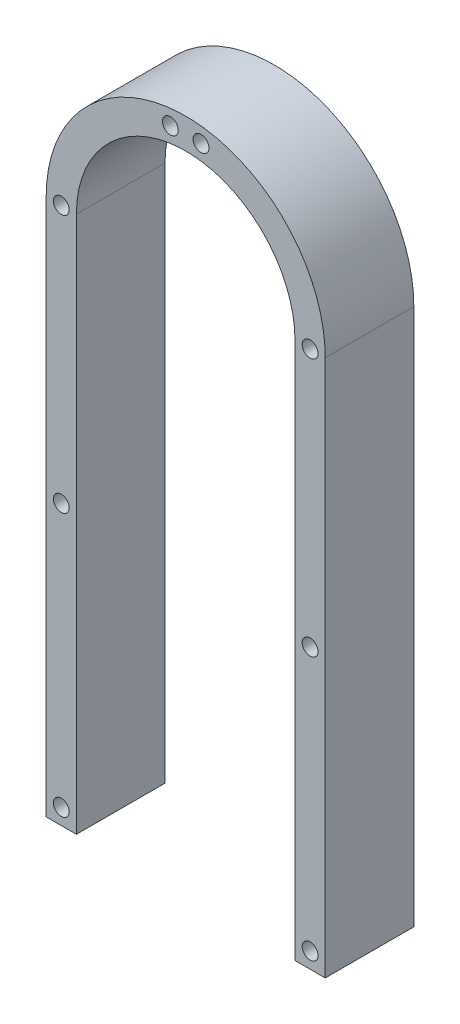
ISO-10303-21;
HEADER;
FILE_DESCRIPTION(('STEP AP214'),'2;1');
FILE_NAME('part.step','',(''),(''),'','','');
FILE_SCHEMA(('AUTOMOTIVE_DESIGN { 1 0 10303 214 1 1 1 1 }'));
ENDSEC;
DATA;
#1=APPLICATION_CONTEXT('core data for automotive mechanical design processes');
#2=APPLICATION_PROTOCOL_DEFINITION('international standard','automotive_design',2000,#1);
#3=PRODUCT_CONTEXT('',#1,'mechanical');
#4=PRODUCT('Part','Part','',(#3));
#5=PRODUCT_RELATED_PRODUCT_CATEGORY('part','',(#4));
#6=PRODUCT_DEFINITION_FORMATION('','',#4);
#7=PRODUCT_DEFINITION_CONTEXT('part definition',#1,'design');
#8=PRODUCT_DEFINITION('design','',#6,#7);
#9=PRODUCT_DEFINITION_SHAPE('','',#8);
#10=(LENGTH_UNIT() NAMED_UNIT(*) SI_UNIT(.MILLI.,.METRE.));
#11=(NAMED_UNIT(*) PLANE_ANGLE_UNIT() SI_UNIT($,.RADIAN.));
#12=(NAMED_UNIT(*) SI_UNIT($,.STERADIAN.) SOLID_ANGLE_UNIT());
#13=UNCERTAINTY_MEASURE_WITH_UNIT(LENGTH_MEASURE(1.E-05),#10,'distance_accuracy_value','');
#14=(GEOMETRIC_REPRESENTATION_CONTEXT(3) GLOBAL_UNCERTAINTY_ASSIGNED_CONTEXT((#13)) GLOBAL_UNIT_ASSIGNED_CONTEXT((#10,
#11,#12)) REPRESENTATION_CONTEXT('',''));
#15=CARTESIAN_POINT('',(0.,0.,0.));
#16=DIRECTION('',(0.,0.,1.));
#17=DIRECTION('',(1.,0.,0.));
#18=AXIS2_PLACEMENT_3D('',#15,#16,#17);
#19=CARTESIAN_POINT('',(-149.085368150531,-18.7891941834329,19.05));
#20=DIRECTION('',(0.,0.,1.));
#21=DIRECTION('',(1.,0.,0.));
#22=AXIS2_PLACEMENT_3D('',#19,#20,#21);
#23=PLANE('',#22);
#24=DIRECTION('',(-1.,0.,0.));
#25=VECTOR('',#24,1.);
#26=CARTESIAN_POINT('',(-149.085368150531,96.6995702810626,19.05));
#27=LINE('',#26,#25);
#28=CARTESIAN_POINT('',(-119.085368150531,96.6995702810626,19.05));
#29=VERTEX_POINT('',#28);
#30=CARTESIAN_POINT('',(-125.585368150531,96.6995702810626,19.05));
#31=VERTEX_POINT('',#30);
#32=EDGE_CURVE('E52',#29,#31,#27,.T.);
#33=ORIENTED_EDGE('',*,*,#32,.F.);
#34=DIRECTION('',(0.,1.,0.));
#35=VECTOR('',#34,1.);
#36=CARTESIAN_POINT('',(-119.085368150531,-18.7891941834329,19.05));
#37=LINE('',#36,#35);
#38=CARTESIAN_POINT('',(-119.085368150531,212.188334745558,19.05));
#39=VERTEX_POINT('',#38);
#40=EDGE_CURVE('E112',#29,#39,#37,.T.);
#41=ORIENTED_EDGE('',*,*,#40,.T.);
#42=CARTESIAN_POINT('',(-149.085368150531,212.188334745558,19.05));
#43=DIRECTION('',(0.,0.,1.));
#44=DIRECTION('',(1.,0.,0.));
#45=AXIS2_PLACEMENT_3D('',#42,#43,#44);
#46=CIRCLE('',#45,30.);
#47=CARTESIAN_POINT('',(-179.085368150531,212.188334745558,19.05));
#48=VERTEX_POINT('',#47);
#49=EDGE_CURVE('E120',#39,#48,#46,.T.);
#50=ORIENTED_EDGE('',*,*,#49,.T.);
#51=DIRECTION('',(0.,-1.,0.));
#52=VECTOR('',#51,1.);
#53=CARTESIAN_POINT('',(-179.085368150531,-18.7891941834329,19.05));
#54=LINE('',#53,#52);
#55=CARTESIAN_POINT('',(-179.085368150531,96.6995702810626,19.05));
#56=VERTEX_POINT('',#55);
#57=EDGE_CURVE('E123',#48,#56,#54,.T.);
#58=ORIENTED_EDGE('',*,*,#57,.T.);
#59=CARTESIAN_POINT('',(-172.585368150531,96.6995702810626,19.05));
#60=VERTEX_POINT('',#59);
#61=EDGE_CURVE('E116',#60,#56,#27,.T.);
#62=ORIENTED_EDGE('',*,*,#61,.F.);
#63=DIRECTION('',(0.,-1.,0.));
#64=VECTOR('',#63,1.);
#65=CARTESIAN_POINT('',(-172.585368150531,-18.7891941834329,19.05));
#66=LINE('',#65,#64);
#67=CARTESIAN_POINT('',(-172.585368150531,212.188334745558,19.05));
#68=VERTEX_POINT('',#67);
#69=EDGE_CURVE('E154',#68,#60,#66,.T.);
#70=ORIENTED_EDGE('',*,*,#69,.F.);
#71=CARTESIAN_POINT('',(-149.085368150531,212.188334745558,19.05));
#72=DIRECTION('',(0.,0.,1.));
#73=DIRECTION('',(1.,0.,0.));
#74=AXIS2_PLACEMENT_3D('',#71,#72,#73);
#75=CIRCLE('',#74,23.5);
#76=CARTESIAN_POINT('',(-125.585368150531,212.188334745558,19.05));
#77=VERTEX_POINT('',#76);
#78=EDGE_CURVE('E160',#77,#68,#75,.T.);
#79=ORIENTED_EDGE('',*,*,#78,.F.);
#80=DIRECTION('',(0.,1.,0.));
#81=VECTOR('',#80,1.);
#82=CARTESIAN_POINT('',(-125.585368150531,-18.7891941834329,19.05));
#83=LINE('',#82,#81);
#84=EDGE_CURVE('E115',#31,#77,#83,.T.);
#85=ORIENTED_EDGE('',*,*,#84,.F.);
#86=EDGE_LOOP('',(#33,#41,#50,#58,#62,#70,#79,#85));
#87=FACE_BOUND('',#86,.T.);
#88=CARTESIAN_POINT('',(-122.335368150531,100.099570281063,19.05));
#89=DIRECTION('',(0.,0.,1.));
#90=DIRECTION('',(1.,0.,0.));
#91=AXIS2_PLACEMENT_3D('',#88,#89,#90);
#92=CIRCLE('',#91,1.7);
#93=CARTESIAN_POINT('',(-120.635368150531,100.099570281063,19.05));
#94=VERTEX_POINT('',#93);
#95=EDGE_CURVE('E106',#94,#94,#92,.T.);
#96=ORIENTED_EDGE('',*,*,#95,.F.);
#97=EDGE_LOOP('',(#96));
#98=FACE_BOUND('',#97,.T.);
#99=CARTESIAN_POINT('',(-152.385368150531,238.734002942083,19.05));
#100=DIRECTION('',(0.,0.,1.));
#101=DIRECTION('',(1.,0.,0.));
#102=AXIS2_PLACEMENT_3D('',#99,#100,#101);
#103=CIRCLE('',#102,1.70000000000001);
#104=CARTESIAN_POINT('',(-150.685368150531,238.734002942083,19.05));
#105=VERTEX_POINT('',#104);
#106=EDGE_CURVE('E212',#105,#105,#103,.T.);
#107=ORIENTED_EDGE('',*,*,#106,.F.);
#108=EDGE_LOOP('',(#107));
#109=FACE_BOUND('',#108,.T.);
#110=CARTESIAN_POINT('',(-122.335368150531,156.699570281063,19.05));
#111=DIRECTION('',(0.,0.,1.));
#112=DIRECTION('',(1.,0.,0.));
#113=AXIS2_PLACEMENT_3D('',#110,#111,#112);
#114=CIRCLE('',#113,1.7);
#115=CARTESIAN_POINT('',(-120.635368150531,156.699570281063,19.05));
#116=VERTEX_POINT('',#115);
#117=EDGE_CURVE('E206',#116,#116,#114,.T.);
#118=ORIENTED_EDGE('',*,*,#117,.F.);
#119=EDGE_LOOP('',(#118));
#120=FACE_BOUND('',#119,.T.);
#121=CARTESIAN_POINT('',(-175.835368150531,156.699570281063,19.05));
#122=DIRECTION('',(0.,0.,1.));
#123=DIRECTION('',(1.,0.,0.));
#124=AXIS2_PLACEMENT_3D('',#121,#122,#123);
#125=CIRCLE('',#124,1.70000000000001);
#126=CARTESIAN_POINT('',(-174.135368150531,156.699570281063,19.05));
#127=VERTEX_POINT('',#126);
#128=EDGE_CURVE('E200',#127,#127,#125,.T.);
#129=ORIENTED_EDGE('',*,*,#128,.F.);
#130=EDGE_LOOP('',(#129));
#131=FACE_BOUND('',#130,.T.);
#132=CARTESIAN_POINT('',(-175.835368150531,100.099570281063,19.05));
#133=DIRECTION('',(0.,0.,1.));
#134=DIRECTION('',(1.,0.,0.));
#135=AXIS2_PLACEMENT_3D('',#132,#133,#134);
#136=CIRCLE('',#135,1.70000000000001);
#137=CARTESIAN_POINT('',(-174.135368150531,100.099570281063,19.05));
#138=VERTEX_POINT('',#137);
#139=EDGE_CURVE('E194',#138,#138,#136,.T.);
#140=ORIENTED_EDGE('',*,*,#139,.F.);
#141=EDGE_LOOP('',(#140));
#142=FACE_BOUND('',#141,.T.);
#143=CARTESIAN_POINT('',(-175.835368150529,212.188334745556,19.05));
#144=DIRECTION('',(0.,0.,1.));
#145=DIRECTION('',(1.,0.,0.));
#146=AXIS2_PLACEMENT_3D('',#143,#144,#145);
#147=CIRCLE('',#146,1.70000000000001);
#148=CARTESIAN_POINT('',(-174.135368150529,212.188334745556,19.05));
#149=VERTEX_POINT('',#148);
#150=EDGE_CURVE('E188',#149,#149,#147,.T.);
#151=ORIENTED_EDGE('',*,*,#150,.F.);
#152=EDGE_LOOP('',(#151));
#153=FACE_BOUND('',#152,.T.);
#154=CARTESIAN_POINT('',(-122.335368150529,212.18833474556,19.05));
#155=DIRECTION('',(0.,0.,1.));
#156=DIRECTION('',(1.,0.,0.));
#157=AXIS2_PLACEMENT_3D('',#154,#155,#156);
#158=CIRCLE('',#157,1.7);
#159=CARTESIAN_POINT('',(-120.635368150529,212.18833474556,19.05));
#160=VERTEX_POINT('',#159);
#161=EDGE_CURVE('E182',#160,#160,#158,.T.);
#162=ORIENTED_EDGE('',*,*,#161,.F.);
#163=EDGE_LOOP('',(#162));
#164=FACE_BOUND('',#163,.T.);
#165=CARTESIAN_POINT('',(-145.785368150531,238.734002942083,19.05));
#166=DIRECTION('',(0.,0.,1.));
#167=DIRECTION('',(1.,0.,0.));
#168=AXIS2_PLACEMENT_3D('',#165,#166,#167);
#169=CIRCLE('',#168,1.70000000000001);
#170=CARTESIAN_POINT('',(-144.085368150531,238.734002942083,19.05));
#171=VERTEX_POINT('',#170);
#172=EDGE_CURVE('E176',#171,#171,#169,.T.);
#173=ORIENTED_EDGE('',*,*,#172,.F.);
#174=EDGE_LOOP('',(#173));
#175=FACE_BOUND('',#174,.T.);
#176=ADVANCED_FACE('F37',(#87,#98,#109,#120,#131,#142,#153,#164,#175),#23,.T.);
#177=CARTESIAN_POINT('',(-149.085368150531,-18.7891941834329,0.));
#178=DIRECTION('',(0.,0.,1.));
#179=DIRECTION('',(1.,0.,0.));
#180=AXIS2_PLACEMENT_3D('',#177,#178,#179);
#181=PLANE('',#180);
#182=CARTESIAN_POINT('',(-122.335368150531,100.099570281063,0.));
#183=DIRECTION('',(0.,0.,1.));
#184=DIRECTION('',(1.,0.,0.));
#185=AXIS2_PLACEMENT_3D('',#182,#183,#184);
#186=CIRCLE('',#185,1.7);
#187=CARTESIAN_POINT('',(-120.635368150531,100.099570281063,0.));
#188=VERTEX_POINT('',#187);
#189=EDGE_CURVE('E215',#188,#188,#186,.T.);
#190=ORIENTED_EDGE('',*,*,#189,.T.);
#191=EDGE_LOOP('',(#190));
#192=FACE_BOUND('',#191,.T.);
#193=CARTESIAN_POINT('',(-152.385368150531,238.734002942083,0.));
#194=DIRECTION('',(0.,0.,1.));
#195=DIRECTION('',(1.,0.,0.));
#196=AXIS2_PLACEMENT_3D('',#193,#194,#195);
#197=CIRCLE('',#196,1.70000000000001);
#198=CARTESIAN_POINT('',(-150.685368150531,238.734002942083,0.));
#199=VERTEX_POINT('',#198);
#200=EDGE_CURVE('E209',#199,#199,#197,.T.);
#201=ORIENTED_EDGE('',*,*,#200,.T.);
#202=EDGE_LOOP('',(#201));
#203=FACE_BOUND('',#202,.T.);
#204=CARTESIAN_POINT('',(-122.335368150531,156.699570281063,0.));
#205=DIRECTION('',(0.,0.,1.));
#206=DIRECTION('',(1.,0.,0.));
#207=AXIS2_PLACEMENT_3D('',#204,#205,#206);
#208=CIRCLE('',#207,1.7);
#209=CARTESIAN_POINT('',(-120.635368150531,156.699570281063,0.));
#210=VERTEX_POINT('',#209);
#211=EDGE_CURVE('E203',#210,#210,#208,.T.);
#212=ORIENTED_EDGE('',*,*,#211,.T.);
#213=EDGE_LOOP('',(#212));
#214=FACE_BOUND('',#213,.T.);
#215=CARTESIAN_POINT('',(-175.835368150531,156.699570281063,0.));
#216=DIRECTION('',(0.,0.,1.));
#217=DIRECTION('',(1.,0.,0.));
#218=AXIS2_PLACEMENT_3D('',#215,#216,#217);
#219=CIRCLE('',#218,1.70000000000001);
#220=CARTESIAN_POINT('',(-174.135368150531,156.699570281063,0.));
#221=VERTEX_POINT('',#220);
#222=EDGE_CURVE('E197',#221,#221,#219,.T.);
#223=ORIENTED_EDGE('',*,*,#222,.T.);
#224=EDGE_LOOP('',(#223));
#225=FACE_BOUND('',#224,.T.);
#226=CARTESIAN_POINT('',(-175.835368150531,100.099570281063,0.));
#227=DIRECTION('',(0.,0.,1.));
#228=DIRECTION('',(1.,0.,0.));
#229=AXIS2_PLACEMENT_3D('',#226,#227,#228);
#230=CIRCLE('',#229,1.70000000000001);
#231=CARTESIAN_POINT('',(-174.135368150531,100.099570281063,0.));
#232=VERTEX_POINT('',#231);
#233=EDGE_CURVE('E191',#232,#232,#230,.T.);
#234=ORIENTED_EDGE('',*,*,#233,.T.);
#235=EDGE_LOOP('',(#234));
#236=FACE_BOUND('',#235,.T.);
#237=CARTESIAN_POINT('',(-175.835368150529,212.188334745556,0.));
#238=DIRECTION('',(0.,0.,1.));
#239=DIRECTION('',(1.,0.,0.));
#240=AXIS2_PLACEMENT_3D('',#237,#238,#239);
#241=CIRCLE('',#240,1.70000000000001);
#242=CARTESIAN_POINT('',(-174.135368150529,212.188334745556,0.));
#243=VERTEX_POINT('',#242);
#244=EDGE_CURVE('E185',#243,#243,#241,.T.);
#245=ORIENTED_EDGE('',*,*,#244,.T.);
#246=EDGE_LOOP('',(#245));
#247=FACE_BOUND('',#246,.T.);
#248=CARTESIAN_POINT('',(-122.335368150529,212.18833474556,0.));
#249=DIRECTION('',(0.,0.,1.));
#250=DIRECTION('',(1.,0.,0.));
#251=AXIS2_PLACEMENT_3D('',#248,#249,#250);
#252=CIRCLE('',#251,1.7);
#253=CARTESIAN_POINT('',(-120.635368150529,212.18833474556,0.));
#254=VERTEX_POINT('',#253);
#255=EDGE_CURVE('E179',#254,#254,#252,.T.);
#256=ORIENTED_EDGE('',*,*,#255,.T.);
#257=EDGE_LOOP('',(#256));
#258=FACE_BOUND('',#257,.T.);
#259=CARTESIAN_POINT('',(-145.785368150531,238.734002942083,0.));
#260=DIRECTION('',(0.,0.,1.));
#261=DIRECTION('',(1.,0.,0.));
#262=AXIS2_PLACEMENT_3D('',#259,#260,#261);
#263=CIRCLE('',#262,1.70000000000001);
#264=CARTESIAN_POINT('',(-144.085368150531,238.734002942083,0.));
#265=VERTEX_POINT('',#264);
#266=EDGE_CURVE('E168',#265,#265,#263,.T.);
#267=ORIENTED_EDGE('',*,*,#266,.T.);
#268=EDGE_LOOP('',(#267));
#269=FACE_BOUND('',#268,.T.);
#270=DIRECTION('',(0.,1.,0.));
#271=VECTOR('',#270,1.);
#272=CARTESIAN_POINT('',(-119.085368150531,-18.7891941834329,0.));
#273=LINE('',#272,#271);
#274=CARTESIAN_POINT('',(-119.085368150531,96.6995702810626,0.));
#275=VERTEX_POINT('',#274);
#276=CARTESIAN_POINT('',(-119.085368150531,212.188334745558,0.));
#277=VERTEX_POINT('',#276);
#278=EDGE_CURVE('E135',#275,#277,#273,.T.);
#279=ORIENTED_EDGE('',*,*,#278,.F.);
#280=DIRECTION('',(-1.,0.,0.));
#281=VECTOR('',#280,1.);
#282=CARTESIAN_POINT('',(-149.085368150531,96.6995702810626,0.));
#283=LINE('',#282,#281);
#284=CARTESIAN_POINT('',(-125.585368150531,96.6995702810626,0.));
#285=VERTEX_POINT('',#284);
#286=EDGE_CURVE('E102',#275,#285,#283,.T.);
#287=ORIENTED_EDGE('',*,*,#286,.T.);
#288=DIRECTION('',(0.,1.,0.));
#289=VECTOR('',#288,1.);
#290=CARTESIAN_POINT('',(-125.585368150531,-18.7891941834329,0.));
#291=LINE('',#290,#289);
#292=CARTESIAN_POINT('',(-125.585368150531,212.188334745558,0.));
#293=VERTEX_POINT('',#292);
#294=EDGE_CURVE('E165',#285,#293,#291,.T.);
#295=ORIENTED_EDGE('',*,*,#294,.T.);
#296=CARTESIAN_POINT('',(-149.085368150531,212.188334745558,0.));
#297=DIRECTION('',(0.,0.,1.));
#298=DIRECTION('',(1.,0.,0.));
#299=AXIS2_PLACEMENT_3D('',#296,#297,#298);
#300=CIRCLE('',#299,23.5);
#301=CARTESIAN_POINT('',(-172.585368150531,212.188334745558,0.));
#302=VERTEX_POINT('',#301);
#303=EDGE_CURVE('E167',#293,#302,#300,.T.);
#304=ORIENTED_EDGE('',*,*,#303,.T.);
#305=DIRECTION('',(0.,-1.,0.));
#306=VECTOR('',#305,1.);
#307=CARTESIAN_POINT('',(-172.585368150531,-18.7891941834329,0.));
#308=LINE('',#307,#306);
#309=CARTESIAN_POINT('',(-172.585368150531,96.6995702810626,0.));
#310=VERTEX_POINT('',#309);
#311=EDGE_CURVE('E171',#302,#310,#308,.T.);
#312=ORIENTED_EDGE('',*,*,#311,.T.);
#313=CARTESIAN_POINT('',(-179.085368150531,96.6995702810626,0.));
#314=VERTEX_POINT('',#313);
#315=EDGE_CURVE('E59',#310,#314,#283,.T.);
#316=ORIENTED_EDGE('',*,*,#315,.T.);
#317=DIRECTION('',(0.,-1.,0.));
#318=VECTOR('',#317,1.);
#319=CARTESIAN_POINT('',(-179.085368150531,-18.7891941834329,0.));
#320=LINE('',#319,#318);
#321=CARTESIAN_POINT('',(-179.085368150531,212.188334745558,0.));
#322=VERTEX_POINT('',#321);
#323=EDGE_CURVE('E121',#322,#314,#320,.T.);
#324=ORIENTED_EDGE('',*,*,#323,.F.);
#325=CARTESIAN_POINT('',(-149.085368150531,212.188334745558,0.));
#326=DIRECTION('',(0.,0.,1.));
#327=DIRECTION('',(1.,0.,0.));
#328=AXIS2_PLACEMENT_3D('',#325,#326,#327);
#329=CIRCLE('',#328,30.);
#330=EDGE_CURVE('E126',#277,#322,#329,.T.);
#331=ORIENTED_EDGE('',*,*,#330,.F.);
#332=EDGE_LOOP('',(#279,#287,#295,#304,#312,#316,#324,#331));
#333=FACE_BOUND('',#332,.T.);
#334=ADVANCED_FACE('F145',(#192,#203,#214,#225,#236,#247,#258,#269,#333),#181,.F.);
#335=CARTESIAN_POINT('',(-119.085368150531,-18.7891941834329,19.05));
#336=DIRECTION('',(-1.,0.,0.));
#337=DIRECTION('',(0.,0.,1.));
#338=AXIS2_PLACEMENT_3D('',#335,#336,#337);
#339=PLANE('',#338);
#340=ORIENTED_EDGE('',*,*,#40,.F.);
#341=DIRECTION('',(0.,0.,-1.));
#342=VECTOR('',#341,1.);
#343=CARTESIAN_POINT('',(-119.085368150531,96.6995702810626,19.05));
#344=LINE('',#343,#342);
#345=EDGE_CURVE('E99',#29,#275,#344,.T.);
#346=ORIENTED_EDGE('',*,*,#345,.T.);
#347=ORIENTED_EDGE('',*,*,#278,.T.);
#348=DIRECTION('',(0.,0.,-1.));
#349=VECTOR('',#348,1.);
#350=CARTESIAN_POINT('',(-119.085368150531,212.188334745558,19.05));
#351=LINE('',#350,#349);
#352=EDGE_CURVE('E45',#39,#277,#351,.T.);
#353=ORIENTED_EDGE('',*,*,#352,.F.);
#354=EDGE_LOOP('',(#340,#346,#347,#353));
#355=FACE_BOUND('',#354,.T.);
#356=ADVANCED_FACE('F39',(#355),#339,.F.);
#357=CARTESIAN_POINT('',(-149.085368150531,212.188334745558,19.05));
#358=DIRECTION('',(0.,0.,-1.));
#359=DIRECTION('',(-1.,0.,0.));
#360=AXIS2_PLACEMENT_3D('',#357,#358,#359);
#361=CYLINDRICAL_SURFACE('',#360,30.);
#362=ORIENTED_EDGE('',*,*,#330,.T.);
#363=DIRECTION('',(0.,0.,-1.));
#364=VECTOR('',#363,1.);
#365=CARTESIAN_POINT('',(-179.085368150531,212.188334745558,19.05));
#366=LINE('',#365,#364);
#367=EDGE_CURVE('E134',#48,#322,#366,.T.);
#368=ORIENTED_EDGE('',*,*,#367,.F.);
#369=ORIENTED_EDGE('',*,*,#49,.F.);
#370=ORIENTED_EDGE('',*,*,#352,.T.);
#371=EDGE_LOOP('',(#362,#368,#369,#370));
#372=FACE_BOUND('',#371,.T.);
#373=ADVANCED_FACE('F141',(#372),#361,.T.);
#374=CARTESIAN_POINT('',(-179.085368150531,-18.7891941834329,19.05));
#375=DIRECTION('',(1.,0.,0.));
#376=DIRECTION('',(0.,0.,-1.));
#377=AXIS2_PLACEMENT_3D('',#374,#375,#376);
#378=PLANE('',#377);
#379=ORIENTED_EDGE('',*,*,#323,.T.);
#380=DIRECTION('',(0.,0.,1.));
#381=VECTOR('',#380,1.);
#382=CARTESIAN_POINT('',(-179.085368150531,96.6995702810626,19.05));
#383=LINE('',#382,#381);
#384=EDGE_CURVE('E107',#314,#56,#383,.T.);
#385=ORIENTED_EDGE('',*,*,#384,.T.);
#386=ORIENTED_EDGE('',*,*,#57,.F.);
#387=ORIENTED_EDGE('',*,*,#367,.T.);
#388=EDGE_LOOP('',(#379,#385,#386,#387));
#389=FACE_BOUND('',#388,.T.);
#390=ADVANCED_FACE('F149',(#389),#378,.F.);
#391=CARTESIAN_POINT('',(-125.585368150531,-18.7891941834329,19.05));
#392=DIRECTION('',(-1.,0.,0.));
#393=DIRECTION('',(0.,-1.,0.));
#394=AXIS2_PLACEMENT_3D('',#391,#392,#393);
#395=PLANE('',#394);
#396=DIRECTION('',(0.,0.,-1.));
#397=VECTOR('',#396,1.);
#398=CARTESIAN_POINT('',(-125.585368150531,96.6995702810626,19.05));
#399=LINE('',#398,#397);
#400=EDGE_CURVE('E223',#31,#285,#399,.T.);
#401=ORIENTED_EDGE('',*,*,#400,.F.);
#402=ORIENTED_EDGE('',*,*,#84,.T.);
#403=DIRECTION('',(0.,0.,-1.));
#404=VECTOR('',#403,1.);
#405=CARTESIAN_POINT('',(-125.585368150531,212.188334745558,19.05));
#406=LINE('',#405,#404);
#407=EDGE_CURVE('E129',#77,#293,#406,.T.);
#408=ORIENTED_EDGE('',*,*,#407,.T.);
#409=ORIENTED_EDGE('',*,*,#294,.F.);
#410=EDGE_LOOP('',(#401,#402,#408,#409));
#411=FACE_BOUND('',#410,.T.);
#412=ADVANCED_FACE('F226',(#411),#395,.T.);
#413=CARTESIAN_POINT('',(-149.085368150531,212.188334745558,19.05));
#414=DIRECTION('',(0.,0.,-1.));
#415=DIRECTION('',(-1.,0.,0.));
#416=AXIS2_PLACEMENT_3D('',#413,#414,#415);
#417=CYLINDRICAL_SURFACE('',#416,23.5);
#418=ORIENTED_EDGE('',*,*,#303,.F.);
#419=ORIENTED_EDGE('',*,*,#407,.F.);
#420=ORIENTED_EDGE('',*,*,#78,.T.);
#421=DIRECTION('',(0.,0.,-1.));
#422=VECTOR('',#421,1.);
#423=CARTESIAN_POINT('',(-172.585368150531,212.188334745558,19.05));
#424=LINE('',#423,#422);
#425=EDGE_CURVE('E158',#68,#302,#424,.T.);
#426=ORIENTED_EDGE('',*,*,#425,.T.);
#427=EDGE_LOOP('',(#418,#419,#420,#426));
#428=FACE_BOUND('',#427,.T.);
#429=ADVANCED_FACE('F229',(#428),#417,.F.);
#430=CARTESIAN_POINT('',(-172.585368150531,-18.7891941834329,19.05));
#431=DIRECTION('',(1.,0.,0.));
#432=DIRECTION('',(0.,1.,0.));
#433=AXIS2_PLACEMENT_3D('',#430,#431,#432);
#434=PLANE('',#433);
#435=DIRECTION('',(0.,0.,1.));
#436=VECTOR('',#435,1.);
#437=CARTESIAN_POINT('',(-172.585368150531,96.6995702810626,19.05));
#438=LINE('',#437,#436);
#439=EDGE_CURVE('E11',#310,#60,#438,.T.);
#440=ORIENTED_EDGE('',*,*,#439,.F.);
#441=ORIENTED_EDGE('',*,*,#311,.F.);
#442=ORIENTED_EDGE('',*,*,#425,.F.);
#443=ORIENTED_EDGE('',*,*,#69,.T.);
#444=EDGE_LOOP('',(#440,#441,#442,#443));
#445=FACE_BOUND('',#444,.T.);
#446=ADVANCED_FACE('F156',(#445),#434,.T.);
#447=CARTESIAN_POINT('',(-145.785368150531,238.734002942083,0.));
#448=DIRECTION('',(0.,0.,1.));
#449=DIRECTION('',(1.,0.,0.));
#450=AXIS2_PLACEMENT_3D('',#447,#448,#449);
#451=CYLINDRICAL_SURFACE('',#450,1.70000000000001);
#452=ORIENTED_EDGE('',*,*,#266,.F.);
#453=EDGE_LOOP('',(#452));
#454=FACE_BOUND('',#453,.T.);
#455=ORIENTED_EDGE('',*,*,#172,.T.);
#456=EDGE_LOOP('',(#455));
#457=FACE_BOUND('',#456,.T.);
#458=ADVANCED_FACE('F236',(#454,#457),#451,.F.);
#459=CARTESIAN_POINT('',(-122.335368150529,212.18833474556,0.));
#460=DIRECTION('',(0.,0.,1.));
#461=DIRECTION('',(1.,0.,0.));
#462=AXIS2_PLACEMENT_3D('',#459,#460,#461);
#463=CYLINDRICAL_SURFACE('',#462,1.7);
#464=ORIENTED_EDGE('',*,*,#255,.F.);
#465=EDGE_LOOP('',(#464));
#466=FACE_BOUND('',#465,.T.);
#467=ORIENTED_EDGE('',*,*,#161,.T.);
#468=EDGE_LOOP('',(#467));
#469=FACE_BOUND('',#468,.T.);
#470=ADVANCED_FACE('F329',(#466,#469),#463,.F.);
#471=CARTESIAN_POINT('',(-175.835368150529,212.188334745556,0.));
#472=DIRECTION('',(0.,0.,1.));
#473=DIRECTION('',(1.,0.,0.));
#474=AXIS2_PLACEMENT_3D('',#471,#472,#473);
#475=CYLINDRICAL_SURFACE('',#474,1.70000000000001);
#476=ORIENTED_EDGE('',*,*,#244,.F.);
#477=EDGE_LOOP('',(#476));
#478=FACE_BOUND('',#477,.T.);
#479=ORIENTED_EDGE('',*,*,#150,.T.);
#480=EDGE_LOOP('',(#479));
#481=FACE_BOUND('',#480,.T.);
#482=ADVANCED_FACE('F319',(#478,#481),#475,.F.);
#483=CARTESIAN_POINT('',(-175.835368150531,100.099570281063,0.));
#484=DIRECTION('',(0.,0.,1.));
#485=DIRECTION('',(1.,0.,0.));
#486=AXIS2_PLACEMENT_3D('',#483,#484,#485);
#487=CYLINDRICAL_SURFACE('',#486,1.70000000000001);
#488=ORIENTED_EDGE('',*,*,#233,.F.);
#489=EDGE_LOOP('',(#488));
#490=FACE_BOUND('',#489,.T.);
#491=ORIENTED_EDGE('',*,*,#139,.T.);
#492=EDGE_LOOP('',(#491));
#493=FACE_BOUND('',#492,.T.);
#494=ADVANCED_FACE('F309',(#490,#493),#487,.F.);
#495=CARTESIAN_POINT('',(-175.835368150531,156.699570281063,0.));
#496=DIRECTION('',(0.,0.,1.));
#497=DIRECTION('',(1.,0.,0.));
#498=AXIS2_PLACEMENT_3D('',#495,#496,#497);
#499=CYLINDRICAL_SURFACE('',#498,1.70000000000001);
#500=ORIENTED_EDGE('',*,*,#222,.F.);
#501=EDGE_LOOP('',(#500));
#502=FACE_BOUND('',#501,.T.);
#503=ORIENTED_EDGE('',*,*,#128,.T.);
#504=EDGE_LOOP('',(#503));
#505=FACE_BOUND('',#504,.T.);
#506=ADVANCED_FACE('F299',(#502,#505),#499,.F.);
#507=CARTESIAN_POINT('',(-122.335368150531,156.699570281063,0.));
#508=DIRECTION('',(0.,0.,1.));
#509=DIRECTION('',(1.,0.,0.));
#510=AXIS2_PLACEMENT_3D('',#507,#508,#509);
#511=CYLINDRICAL_SURFACE('',#510,1.7);
#512=ORIENTED_EDGE('',*,*,#211,.F.);
#513=EDGE_LOOP('',(#512));
#514=FACE_BOUND('',#513,.T.);
#515=ORIENTED_EDGE('',*,*,#117,.T.);
#516=EDGE_LOOP('',(#515));
#517=FACE_BOUND('',#516,.T.);
#518=ADVANCED_FACE('F289',(#514,#517),#511,.F.);
#519=CARTESIAN_POINT('',(-152.385368150531,238.734002942083,0.));
#520=DIRECTION('',(0.,0.,1.));
#521=DIRECTION('',(1.,0.,0.));
#522=AXIS2_PLACEMENT_3D('',#519,#520,#521);
#523=CYLINDRICAL_SURFACE('',#522,1.70000000000001);
#524=ORIENTED_EDGE('',*,*,#200,.F.);
#525=EDGE_LOOP('',(#524));
#526=FACE_BOUND('',#525,.T.);
#527=ORIENTED_EDGE('',*,*,#106,.T.);
#528=EDGE_LOOP('',(#527));
#529=FACE_BOUND('',#528,.T.);
#530=ADVANCED_FACE('F277',(#526,#529),#523,.F.);
#531=CARTESIAN_POINT('',(-122.335368150531,100.099570281063,0.));
#532=DIRECTION('',(0.,0.,1.));
#533=DIRECTION('',(1.,0.,0.));
#534=AXIS2_PLACEMENT_3D('',#531,#532,#533);
#535=CYLINDRICAL_SURFACE('',#534,1.7);
#536=ORIENTED_EDGE('',*,*,#189,.F.);
#537=EDGE_LOOP('',(#536));
#538=FACE_BOUND('',#537,.T.);
#539=ORIENTED_EDGE('',*,*,#95,.T.);
#540=EDGE_LOOP('',(#539));
#541=FACE_BOUND('',#540,.T.);
#542=ADVANCED_FACE('F271',(#538,#541),#535,.F.);
#543=CARTESIAN_POINT('',(-149.085368150531,96.6995702810626,0.));
#544=DIRECTION('',(0.,1.,0.));
#545=DIRECTION('',(0.,0.,1.));
#546=AXIS2_PLACEMENT_3D('',#543,#544,#545);
#547=PLANE('',#546);
#548=ORIENTED_EDGE('',*,*,#315,.F.);
#549=ORIENTED_EDGE('',*,*,#439,.T.);
#550=ORIENTED_EDGE('',*,*,#61,.T.);
#551=ORIENTED_EDGE('',*,*,#384,.F.);
#552=EDGE_LOOP('',(#548,#549,#550,#551));
#553=FACE_BOUND('',#552,.T.);
#554=ADVANCED_FACE('F276',(#553),#547,.F.);
#555=ORIENTED_EDGE('',*,*,#32,.T.);
#556=ORIENTED_EDGE('',*,*,#400,.T.);
#557=ORIENTED_EDGE('',*,*,#286,.F.);
#558=ORIENTED_EDGE('',*,*,#345,.F.);
#559=EDGE_LOOP('',(#555,#556,#557,#558));
#560=FACE_BOUND('',#559,.T.);
#561=ADVANCED_FACE('F100',(#560),#547,.F.);
#562=CLOSED_SHELL('',(#176,#334,#356,#373,#390,#412,#429,#446,#458,#470,#482,#494,#506,#518,
#530,#542,#554,#561));
#563=MANIFOLD_SOLID_BREP('B2',#562);
#564=ADVANCED_BREP_SHAPE_REPRESENTATION('',(#18,#563),#14);
#565=SHAPE_DEFINITION_REPRESENTATION(#9,#564);
ENDSEC;
END-ISO-10303-21;
